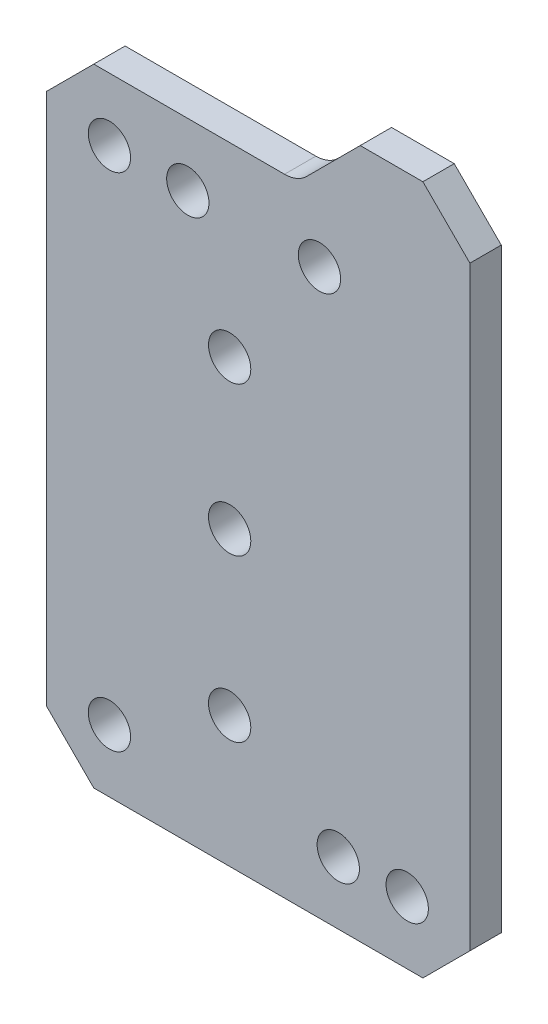
ISO-10303-21;
HEADER;
FILE_DESCRIPTION(('STEP AP214'),'2;1');
FILE_NAME('part.step','',(''),(''),'','','');
FILE_SCHEMA(('AUTOMOTIVE_DESIGN { 1 0 10303 214 1 1 1 1 }'));
ENDSEC;
DATA;
#1=APPLICATION_CONTEXT('core data for automotive mechanical design processes');
#2=APPLICATION_PROTOCOL_DEFINITION('international standard','automotive_design',2000,#1);
#3=PRODUCT_CONTEXT('',#1,'mechanical');
#4=PRODUCT('Part','Part','',(#3));
#5=PRODUCT_RELATED_PRODUCT_CATEGORY('part','',(#4));
#6=PRODUCT_DEFINITION_FORMATION('','',#4);
#7=PRODUCT_DEFINITION_CONTEXT('part definition',#1,'design');
#8=PRODUCT_DEFINITION('design','',#6,#7);
#9=PRODUCT_DEFINITION_SHAPE('','',#8);
#10=(LENGTH_UNIT() NAMED_UNIT(*) SI_UNIT(.MILLI.,.METRE.));
#11=(NAMED_UNIT(*) PLANE_ANGLE_UNIT() SI_UNIT($,.RADIAN.));
#12=(NAMED_UNIT(*) SI_UNIT($,.STERADIAN.) SOLID_ANGLE_UNIT());
#13=UNCERTAINTY_MEASURE_WITH_UNIT(LENGTH_MEASURE(1.E-05),#10,'distance_accuracy_value','');
#14=(GEOMETRIC_REPRESENTATION_CONTEXT(3) GLOBAL_UNCERTAINTY_ASSIGNED_CONTEXT((#13)) GLOBAL_UNIT_ASSIGNED_CONTEXT((#10,
#11,#12)) REPRESENTATION_CONTEXT('',''));
#15=CARTESIAN_POINT('',(0.,0.,0.));
#16=DIRECTION('',(0.,0.,1.));
#17=DIRECTION('',(1.,0.,0.));
#18=AXIS2_PLACEMENT_3D('',#15,#16,#17);
#19=CARTESIAN_POINT('',(545.756400678806,644.999999999951,10.));
#20=DIRECTION('',(0.,0.,1.));
#21=DIRECTION('',(1.,0.,0.));
#22=AXIS2_PLACEMENT_3D('',#19,#20,#21);
#23=PLANE('',#22);
#24=CARTESIAN_POINT('',(489.898536302537,614.999999999951,10.));
#25=DIRECTION('',(0.,0.,1.));
#26=DIRECTION('',(1.,0.,0.));
#27=AXIS2_PLACEMENT_3D('',#24,#25,#26);
#28=CIRCLE('',#27,6.74999999999996);
#29=CARTESIAN_POINT('',(496.648536302537,614.999999999951,10.));
#30=VERTEX_POINT('',#29);
#31=EDGE_CURVE('E301',#30,#30,#28,.T.);
#32=ORIENTED_EDGE('',*,*,#31,.F.);
#33=EDGE_LOOP('',(#32));
#34=FACE_BOUND('',#33,.T.);
#35=CARTESIAN_POINT('',(528.246102143016,575.749727554119,10.));
#36=DIRECTION('',(0.,0.,1.));
#37=DIRECTION('',(1.,0.,0.));
#38=AXIS2_PLACEMENT_3D('',#35,#36,#37);
#39=CIRCLE('',#38,6.75000000000005);
#40=CARTESIAN_POINT('',(534.996102143016,575.749727554119,10.));
#41=VERTEX_POINT('',#40);
#42=EDGE_CURVE('E313',#41,#41,#39,.T.);
#43=ORIENTED_EDGE('',*,*,#42,.F.);
#44=EDGE_LOOP('',(#43));
#45=FACE_BOUND('',#44,.T.);
#46=CARTESIAN_POINT('',(528.246102145376,476.749727554119,10.));
#47=DIRECTION('',(0.,0.,1.));
#48=DIRECTION('',(1.,0.,0.));
#49=AXIS2_PLACEMENT_3D('',#46,#47,#48);
#50=CIRCLE('',#49,6.75000000000003);
#51=CARTESIAN_POINT('',(534.996102145376,476.749727554119,10.));
#52=VERTEX_POINT('',#51);
#53=EDGE_CURVE('E325',#52,#52,#50,.T.);
#54=ORIENTED_EDGE('',*,*,#53,.F.);
#55=EDGE_LOOP('',(#54));
#56=FACE_BOUND('',#55,.T.);
#57=CARTESIAN_POINT('',(562.898536302537,454.999999999951,10.));
#58=DIRECTION('',(0.,0.,1.));
#59=DIRECTION('',(1.,0.,0.));
#60=AXIS2_PLACEMENT_3D('',#57,#58,#59);
#61=CIRCLE('',#60,6.75000000000003);
#62=CARTESIAN_POINT('',(569.648536302537,454.999999999951,10.));
#63=VERTEX_POINT('',#62);
#64=EDGE_CURVE('E337',#63,#63,#61,.T.);
#65=ORIENTED_EDGE('',*,*,#64,.F.);
#66=EDGE_LOOP('',(#65));
#67=FACE_BOUND('',#66,.T.);
#68=DIRECTION('',(-0.707106781186545,-0.70710678118655,0.));
#69=VECTOR('',#68,1.);
#70=CARTESIAN_POINT('',(484.898536302537,634.999999999951,10.));
#71=LINE('',#70,#69);
#72=CARTESIAN_POINT('',(484.898536302537,634.999999999951,10.));
#73=VERTEX_POINT('',#72);
#74=CARTESIAN_POINT('',(469.898536302537,619.999999999951,10.));
#75=VERTEX_POINT('',#74);
#76=EDGE_CURVE('E172',#73,#75,#71,.T.);
#77=ORIENTED_EDGE('',*,*,#76,.T.);
#78=DIRECTION('',(0.,-1.,0.));
#79=VECTOR('',#78,1.);
#80=CARTESIAN_POINT('',(469.898536302537,619.999999999951,10.));
#81=LINE('',#80,#79);
#82=CARTESIAN_POINT('',(469.898536302537,449.999999999951,10.));
#83=VERTEX_POINT('',#82);
#84=EDGE_CURVE('E105',#75,#83,#81,.T.);
#85=ORIENTED_EDGE('',*,*,#84,.T.);
#86=DIRECTION('',(0.707106781186548,-0.707106781186548,0.));
#87=VECTOR('',#86,1.);
#88=CARTESIAN_POINT('',(469.898536302537,449.999999999951,10.));
#89=LINE('',#88,#87);
#90=CARTESIAN_POINT('',(484.898536302538,434.999999999951,10.));
#91=VERTEX_POINT('',#90);
#92=EDGE_CURVE('E196',#83,#91,#89,.T.);
#93=ORIENTED_EDGE('',*,*,#92,.T.);
#94=DIRECTION('',(1.,0.,0.));
#95=VECTOR('',#94,1.);
#96=CARTESIAN_POINT('',(484.898536302538,434.999999999951,10.));
#97=LINE('',#96,#95);
#98=CARTESIAN_POINT('',(589.898536302537,434.999999999951,10.));
#99=VERTEX_POINT('',#98);
#100=EDGE_CURVE('E215',#91,#99,#97,.T.);
#101=ORIENTED_EDGE('',*,*,#100,.T.);
#102=DIRECTION('',(0.707106781186548,0.707106781186548,0.));
#103=VECTOR('',#102,1.);
#104=CARTESIAN_POINT('',(589.898536302537,434.999999999951,10.));
#105=LINE('',#104,#103);
#106=CARTESIAN_POINT('',(604.898536302537,449.999999999951,10.));
#107=VERTEX_POINT('',#106);
#108=EDGE_CURVE('E212',#99,#107,#105,.T.);
#109=ORIENTED_EDGE('',*,*,#108,.T.);
#110=DIRECTION('',(0.,1.,0.));
#111=VECTOR('',#110,1.);
#112=CARTESIAN_POINT('',(604.898536302537,449.999999999951,10.));
#113=LINE('',#112,#111);
#114=CARTESIAN_POINT('',(604.898536302537,639.999999999951,10.));
#115=VERTEX_POINT('',#114);
#116=EDGE_CURVE('E214',#107,#115,#113,.T.);
#117=ORIENTED_EDGE('',*,*,#116,.T.);
#118=DIRECTION('',(-0.707106781186548,0.707106781186548,0.));
#119=VECTOR('',#118,1.);
#120=CARTESIAN_POINT('',(604.898536302537,639.999999999951,10.));
#121=LINE('',#120,#119);
#122=CARTESIAN_POINT('',(589.898536302537,654.999999999951,10.));
#123=VERTEX_POINT('',#122);
#124=EDGE_CURVE('E217',#115,#123,#121,.T.);
#125=ORIENTED_EDGE('',*,*,#124,.T.);
#126=DIRECTION('',(-1.,0.,0.));
#127=VECTOR('',#126,1.);
#128=CARTESIAN_POINT('',(589.898536302537,654.999999999951,10.));
#129=LINE('',#128,#127);
#130=CARTESIAN_POINT('',(569.898536302537,654.999999999951,10.));
#131=VERTEX_POINT('',#130);
#132=EDGE_CURVE('E133',#123,#131,#129,.T.);
#133=ORIENTED_EDGE('',*,*,#132,.T.);
#134=DIRECTION('',(-0.70710678118655,-0.707106781186545,0.));
#135=VECTOR('',#134,1.);
#136=CARTESIAN_POINT('',(569.898536302537,654.999999999951,10.));
#137=LINE('',#136,#135);
#138=CARTESIAN_POINT('',(552.827468490672,637.928932188085,10.));
#139=VERTEX_POINT('',#138);
#140=EDGE_CURVE('E127',#131,#139,#137,.T.);
#141=ORIENTED_EDGE('',*,*,#140,.T.);
#142=CARTESIAN_POINT('',(545.756400678806,644.999999999951,10.));
#143=DIRECTION('',(0.,0.,-1.));
#144=DIRECTION('',(1.,0.,0.));
#145=AXIS2_PLACEMENT_3D('',#142,#143,#144);
#146=CIRCLE('',#145,9.99999999999997);
#147=CARTESIAN_POINT('',(545.756400678806,634.999999999951,10.));
#148=VERTEX_POINT('',#147);
#149=EDGE_CURVE('E131',#139,#148,#146,.T.);
#150=ORIENTED_EDGE('',*,*,#149,.T.);
#151=DIRECTION('',(-1.,0.,0.));
#152=VECTOR('',#151,1.);
#153=CARTESIAN_POINT('',(545.756400678806,634.999999999951,10.));
#154=LINE('',#153,#152);
#155=EDGE_CURVE('E53',#148,#73,#154,.T.);
#156=ORIENTED_EDGE('',*,*,#155,.T.);
#157=EDGE_LOOP('',(#77,#85,#93,#101,#109,#117,#125,#133,#141,#150,#156));
#158=FACE_BOUND('',#157,.T.);
#159=CARTESIAN_POINT('',(584.898536302537,454.999999999951,10.));
#160=DIRECTION('',(0.,0.,1.));
#161=DIRECTION('',(1.,0.,0.));
#162=AXIS2_PLACEMENT_3D('',#159,#160,#161);
#163=CIRCLE('',#162,6.75000000000003);
#164=CARTESIAN_POINT('',(591.648536302537,454.999999999951,10.));
#165=VERTEX_POINT('',#164);
#166=EDGE_CURVE('E155',#165,#165,#163,.T.);
#167=ORIENTED_EDGE('',*,*,#166,.F.);
#168=EDGE_LOOP('',(#167));
#169=FACE_BOUND('',#168,.T.);
#170=CARTESIAN_POINT('',(489.898536302537,454.999999999951,10.));
#171=DIRECTION('',(0.,0.,1.));
#172=DIRECTION('',(1.,0.,0.));
#173=AXIS2_PLACEMENT_3D('',#170,#171,#172);
#174=CIRCLE('',#173,6.74999999999998);
#175=CARTESIAN_POINT('',(496.648536302537,454.999999999951,10.));
#176=VERTEX_POINT('',#175);
#177=EDGE_CURVE('E331',#176,#176,#174,.T.);
#178=ORIENTED_EDGE('',*,*,#177,.F.);
#179=EDGE_LOOP('',(#178));
#180=FACE_BOUND('',#179,.T.);
#181=CARTESIAN_POINT('',(528.246102144148,528.249727554119,10.));
#182=DIRECTION('',(0.,0.,1.));
#183=DIRECTION('',(1.,0.,0.));
#184=AXIS2_PLACEMENT_3D('',#181,#182,#183);
#185=CIRCLE('',#184,6.75000000000005);
#186=CARTESIAN_POINT('',(534.996102144148,528.249727554119,10.));
#187=VERTEX_POINT('',#186);
#188=EDGE_CURVE('E319',#187,#187,#185,.T.);
#189=ORIENTED_EDGE('',*,*,#188,.F.);
#190=EDGE_LOOP('',(#189));
#191=FACE_BOUND('',#190,.T.);
#192=CARTESIAN_POINT('',(514.898536302537,614.999999999951,10.));
#193=DIRECTION('',(0.,0.,1.));
#194=DIRECTION('',(1.,0.,0.));
#195=AXIS2_PLACEMENT_3D('',#192,#193,#194);
#196=CIRCLE('',#195,6.75000000000005);
#197=CARTESIAN_POINT('',(521.648536302537,614.999999999951,10.));
#198=VERTEX_POINT('',#197);
#199=EDGE_CURVE('E307',#198,#198,#196,.T.);
#200=ORIENTED_EDGE('',*,*,#199,.F.);
#201=EDGE_LOOP('',(#200));
#202=FACE_BOUND('',#201,.T.);
#203=CARTESIAN_POINT('',(556.898536302537,614.999999999951,10.));
#204=DIRECTION('',(0.,0.,1.));
#205=DIRECTION('',(1.,0.,0.));
#206=AXIS2_PLACEMENT_3D('',#203,#204,#205);
#207=CIRCLE('',#206,6.75000000000005);
#208=CARTESIAN_POINT('',(563.648536302537,614.999999999951,10.));
#209=VERTEX_POINT('',#208);
#210=EDGE_CURVE('E292',#209,#209,#207,.T.);
#211=ORIENTED_EDGE('',*,*,#210,.F.);
#212=EDGE_LOOP('',(#211));
#213=FACE_BOUND('',#212,.T.);
#214=ADVANCED_FACE('F36',(#34,#45,#56,#67,#158,#169,#180,#191,#202,#213),#23,.T.);
#215=CARTESIAN_POINT('',(545.756400678806,644.999999999951,0.));
#216=DIRECTION('',(0.,0.,1.));
#217=DIRECTION('',(1.,0.,0.));
#218=AXIS2_PLACEMENT_3D('',#215,#216,#217);
#219=PLANE('',#218);
#220=CARTESIAN_POINT('',(489.898536302537,614.999999999951,0.));
#221=DIRECTION('',(0.,0.,1.));
#222=DIRECTION('',(1.,0.,0.));
#223=AXIS2_PLACEMENT_3D('',#220,#221,#222);
#224=CIRCLE('',#223,6.74999999999996);
#225=CARTESIAN_POINT('',(496.648536302537,614.999999999951,0.));
#226=VERTEX_POINT('',#225);
#227=EDGE_CURVE('E298',#226,#226,#224,.T.);
#228=ORIENTED_EDGE('',*,*,#227,.T.);
#229=EDGE_LOOP('',(#228));
#230=FACE_BOUND('',#229,.T.);
#231=CARTESIAN_POINT('',(528.246102143016,575.749727554119,0.));
#232=DIRECTION('',(0.,0.,1.));
#233=DIRECTION('',(1.,0.,0.));
#234=AXIS2_PLACEMENT_3D('',#231,#232,#233);
#235=CIRCLE('',#234,6.75000000000005);
#236=CARTESIAN_POINT('',(534.996102143016,575.749727554119,0.));
#237=VERTEX_POINT('',#236);
#238=EDGE_CURVE('E310',#237,#237,#235,.T.);
#239=ORIENTED_EDGE('',*,*,#238,.T.);
#240=EDGE_LOOP('',(#239));
#241=FACE_BOUND('',#240,.T.);
#242=CARTESIAN_POINT('',(528.246102145376,476.749727554119,0.));
#243=DIRECTION('',(0.,0.,1.));
#244=DIRECTION('',(1.,0.,0.));
#245=AXIS2_PLACEMENT_3D('',#242,#243,#244);
#246=CIRCLE('',#245,6.75000000000003);
#247=CARTESIAN_POINT('',(534.996102145376,476.749727554119,0.));
#248=VERTEX_POINT('',#247);
#249=EDGE_CURVE('E322',#248,#248,#246,.T.);
#250=ORIENTED_EDGE('',*,*,#249,.T.);
#251=EDGE_LOOP('',(#250));
#252=FACE_BOUND('',#251,.T.);
#253=CARTESIAN_POINT('',(562.898536302537,454.999999999951,0.));
#254=DIRECTION('',(0.,0.,1.));
#255=DIRECTION('',(1.,0.,0.));
#256=AXIS2_PLACEMENT_3D('',#253,#254,#255);
#257=CIRCLE('',#256,6.75000000000003);
#258=CARTESIAN_POINT('',(569.648536302537,454.999999999951,0.));
#259=VERTEX_POINT('',#258);
#260=EDGE_CURVE('E334',#259,#259,#257,.T.);
#261=ORIENTED_EDGE('',*,*,#260,.T.);
#262=EDGE_LOOP('',(#261));
#263=FACE_BOUND('',#262,.T.);
#264=DIRECTION('',(-0.707106781186545,-0.70710678118655,0.));
#265=VECTOR('',#264,1.);
#266=CARTESIAN_POINT('',(484.898536302537,634.999999999951,0.));
#267=LINE('',#266,#265);
#268=CARTESIAN_POINT('',(484.898536302537,634.999999999951,0.));
#269=VERTEX_POINT('',#268);
#270=CARTESIAN_POINT('',(469.898536302537,619.999999999951,0.));
#271=VERTEX_POINT('',#270);
#272=EDGE_CURVE('E151',#269,#271,#267,.T.);
#273=ORIENTED_EDGE('',*,*,#272,.F.);
#274=DIRECTION('',(-1.,0.,0.));
#275=VECTOR('',#274,1.);
#276=CARTESIAN_POINT('',(545.756400678806,634.999999999951,0.));
#277=LINE('',#276,#275);
#278=CARTESIAN_POINT('',(545.756400678806,634.999999999951,0.));
#279=VERTEX_POINT('',#278);
#280=EDGE_CURVE('E97',#279,#269,#277,.T.);
#281=ORIENTED_EDGE('',*,*,#280,.F.);
#282=CARTESIAN_POINT('',(545.756400678806,644.999999999951,0.));
#283=DIRECTION('',(0.,0.,-1.));
#284=DIRECTION('',(1.,0.,0.));
#285=AXIS2_PLACEMENT_3D('',#282,#283,#284);
#286=CIRCLE('',#285,9.99999999999997);
#287=CARTESIAN_POINT('',(552.827468490672,637.928932188085,0.));
#288=VERTEX_POINT('',#287);
#289=EDGE_CURVE('E91',#288,#279,#286,.T.);
#290=ORIENTED_EDGE('',*,*,#289,.F.);
#291=DIRECTION('',(-0.70710678118655,-0.707106781186545,0.));
#292=VECTOR('',#291,1.);
#293=CARTESIAN_POINT('',(569.898536302537,654.999999999951,0.));
#294=LINE('',#293,#292);
#295=CARTESIAN_POINT('',(569.898536302537,654.999999999951,0.));
#296=VERTEX_POINT('',#295);
#297=EDGE_CURVE('E141',#296,#288,#294,.T.);
#298=ORIENTED_EDGE('',*,*,#297,.F.);
#299=DIRECTION('',(-1.,0.,0.));
#300=VECTOR('',#299,1.);
#301=CARTESIAN_POINT('',(589.898536302537,654.999999999951,0.));
#302=LINE('',#301,#300);
#303=CARTESIAN_POINT('',(589.898536302537,654.999999999951,0.));
#304=VERTEX_POINT('',#303);
#305=EDGE_CURVE('E167',#304,#296,#302,.T.);
#306=ORIENTED_EDGE('',*,*,#305,.F.);
#307=DIRECTION('',(-0.707106781186548,0.707106781186548,0.));
#308=VECTOR('',#307,1.);
#309=CARTESIAN_POINT('',(604.898536302537,639.999999999951,0.));
#310=LINE('',#309,#308);
#311=CARTESIAN_POINT('',(604.898536302537,639.999999999951,0.));
#312=VERTEX_POINT('',#311);
#313=EDGE_CURVE('E165',#312,#304,#310,.T.);
#314=ORIENTED_EDGE('',*,*,#313,.F.);
#315=DIRECTION('',(0.,1.,0.));
#316=VECTOR('',#315,1.);
#317=CARTESIAN_POINT('',(604.898536302537,449.999999999951,0.));
#318=LINE('',#317,#316);
#319=CARTESIAN_POINT('',(604.898536302537,449.999999999951,0.));
#320=VERTEX_POINT('',#319);
#321=EDGE_CURVE('E163',#320,#312,#318,.T.);
#322=ORIENTED_EDGE('',*,*,#321,.F.);
#323=DIRECTION('',(0.707106781186548,0.707106781186548,0.));
#324=VECTOR('',#323,1.);
#325=CARTESIAN_POINT('',(589.898536302537,434.999999999951,0.));
#326=LINE('',#325,#324);
#327=CARTESIAN_POINT('',(589.898536302537,434.999999999951,0.));
#328=VERTEX_POINT('',#327);
#329=EDGE_CURVE('E161',#328,#320,#326,.T.);
#330=ORIENTED_EDGE('',*,*,#329,.F.);
#331=DIRECTION('',(1.,0.,0.));
#332=VECTOR('',#331,1.);
#333=CARTESIAN_POINT('',(484.898536302538,434.999999999951,0.));
#334=LINE('',#333,#332);
#335=CARTESIAN_POINT('',(484.898536302538,434.999999999951,0.));
#336=VERTEX_POINT('',#335);
#337=EDGE_CURVE('E159',#336,#328,#334,.T.);
#338=ORIENTED_EDGE('',*,*,#337,.F.);
#339=DIRECTION('',(0.707106781186548,-0.707106781186548,0.));
#340=VECTOR('',#339,1.);
#341=CARTESIAN_POINT('',(469.898536302537,449.999999999951,0.));
#342=LINE('',#341,#340);
#343=CARTESIAN_POINT('',(469.898536302537,449.999999999951,0.));
#344=VERTEX_POINT('',#343);
#345=EDGE_CURVE('E157',#344,#336,#342,.T.);
#346=ORIENTED_EDGE('',*,*,#345,.F.);
#347=DIRECTION('',(0.,-1.,0.));
#348=VECTOR('',#347,1.);
#349=CARTESIAN_POINT('',(469.898536302537,619.999999999951,0.));
#350=LINE('',#349,#348);
#351=EDGE_CURVE('E154',#271,#344,#350,.T.);
#352=ORIENTED_EDGE('',*,*,#351,.F.);
#353=EDGE_LOOP('',(#273,#281,#290,#298,#306,#314,#322,#330,#338,#346,#352));
#354=FACE_BOUND('',#353,.T.);
#355=CARTESIAN_POINT('',(584.898536302537,454.999999999951,0.));
#356=DIRECTION('',(0.,0.,1.));
#357=DIRECTION('',(1.,0.,0.));
#358=AXIS2_PLACEMENT_3D('',#355,#356,#357);
#359=CIRCLE('',#358,6.75000000000003);
#360=CARTESIAN_POINT('',(591.648536302537,454.999999999951,0.));
#361=VERTEX_POINT('',#360);
#362=EDGE_CURVE('E340',#361,#361,#359,.T.);
#363=ORIENTED_EDGE('',*,*,#362,.T.);
#364=EDGE_LOOP('',(#363));
#365=FACE_BOUND('',#364,.T.);
#366=CARTESIAN_POINT('',(489.898536302537,454.999999999951,0.));
#367=DIRECTION('',(0.,0.,1.));
#368=DIRECTION('',(1.,0.,0.));
#369=AXIS2_PLACEMENT_3D('',#366,#367,#368);
#370=CIRCLE('',#369,6.74999999999998);
#371=CARTESIAN_POINT('',(496.648536302537,454.999999999951,0.));
#372=VERTEX_POINT('',#371);
#373=EDGE_CURVE('E328',#372,#372,#370,.T.);
#374=ORIENTED_EDGE('',*,*,#373,.T.);
#375=EDGE_LOOP('',(#374));
#376=FACE_BOUND('',#375,.T.);
#377=CARTESIAN_POINT('',(528.246102144148,528.249727554119,0.));
#378=DIRECTION('',(0.,0.,1.));
#379=DIRECTION('',(1.,0.,0.));
#380=AXIS2_PLACEMENT_3D('',#377,#378,#379);
#381=CIRCLE('',#380,6.75000000000005);
#382=CARTESIAN_POINT('',(534.996102144148,528.249727554119,0.));
#383=VERTEX_POINT('',#382);
#384=EDGE_CURVE('E316',#383,#383,#381,.T.);
#385=ORIENTED_EDGE('',*,*,#384,.T.);
#386=EDGE_LOOP('',(#385));
#387=FACE_BOUND('',#386,.T.);
#388=CARTESIAN_POINT('',(514.898536302537,614.999999999951,0.));
#389=DIRECTION('',(0.,0.,1.));
#390=DIRECTION('',(1.,0.,0.));
#391=AXIS2_PLACEMENT_3D('',#388,#389,#390);
#392=CIRCLE('',#391,6.75000000000005);
#393=CARTESIAN_POINT('',(521.648536302537,614.999999999951,0.));
#394=VERTEX_POINT('',#393);
#395=EDGE_CURVE('E304',#394,#394,#392,.T.);
#396=ORIENTED_EDGE('',*,*,#395,.T.);
#397=EDGE_LOOP('',(#396));
#398=FACE_BOUND('',#397,.T.);
#399=CARTESIAN_POINT('',(556.898536302537,614.999999999951,0.));
#400=DIRECTION('',(0.,0.,1.));
#401=DIRECTION('',(1.,0.,0.));
#402=AXIS2_PLACEMENT_3D('',#399,#400,#401);
#403=CIRCLE('',#402,6.75000000000005);
#404=CARTESIAN_POINT('',(563.648536302537,614.999999999951,0.));
#405=VERTEX_POINT('',#404);
#406=EDGE_CURVE('E295',#405,#405,#403,.T.);
#407=ORIENTED_EDGE('',*,*,#406,.T.);
#408=EDGE_LOOP('',(#407));
#409=FACE_BOUND('',#408,.T.);
#410=ADVANCED_FACE('F200',(#230,#241,#252,#263,#354,#365,#376,#387,#398,#409),#219,.F.);
#411=CARTESIAN_POINT('',(484.898536302537,634.999999999951,10.));
#412=DIRECTION('',(0.70710678118655,-0.707106781186545,0.));
#413=DIRECTION('',(0.707106781186545,0.70710678118655,0.));
#414=AXIS2_PLACEMENT_3D('',#411,#412,#413);
#415=PLANE('',#414);
#416=ORIENTED_EDGE('',*,*,#272,.T.);
#417=DIRECTION('',(0.,0.,-1.));
#418=VECTOR('',#417,1.);
#419=CARTESIAN_POINT('',(469.898536302537,619.999999999951,10.));
#420=LINE('',#419,#418);
#421=EDGE_CURVE('E11',#75,#271,#420,.T.);
#422=ORIENTED_EDGE('',*,*,#421,.F.);
#423=ORIENTED_EDGE('',*,*,#76,.F.);
#424=DIRECTION('',(0.,0.,-1.));
#425=VECTOR('',#424,1.);
#426=CARTESIAN_POINT('',(484.898536302537,634.999999999951,10.));
#427=LINE('',#426,#425);
#428=EDGE_CURVE('E147',#73,#269,#427,.T.);
#429=ORIENTED_EDGE('',*,*,#428,.T.);
#430=EDGE_LOOP('',(#416,#422,#423,#429));
#431=FACE_BOUND('',#430,.T.);
#432=ADVANCED_FACE('F38',(#431),#415,.F.);
#433=CARTESIAN_POINT('',(469.898536302537,619.999999999951,10.));
#434=DIRECTION('',(1.,0.,0.));
#435=DIRECTION('',(0.,1.,0.));
#436=AXIS2_PLACEMENT_3D('',#433,#434,#435);
#437=PLANE('',#436);
#438=ORIENTED_EDGE('',*,*,#351,.T.);
#439=DIRECTION('',(0.,0.,-1.));
#440=VECTOR('',#439,1.);
#441=CARTESIAN_POINT('',(469.898536302537,449.999999999951,10.));
#442=LINE('',#441,#440);
#443=EDGE_CURVE('E45',#83,#344,#442,.T.);
#444=ORIENTED_EDGE('',*,*,#443,.F.);
#445=ORIENTED_EDGE('',*,*,#84,.F.);
#446=ORIENTED_EDGE('',*,*,#421,.T.);
#447=EDGE_LOOP('',(#438,#444,#445,#446));
#448=FACE_BOUND('',#447,.T.);
#449=ADVANCED_FACE('F527',(#448),#437,.F.);
#450=CARTESIAN_POINT('',(469.898536302537,449.999999999951,10.));
#451=DIRECTION('',(0.707106781186548,0.707106781186548,0.));
#452=DIRECTION('',(-0.707106781186548,0.707106781186548,0.));
#453=AXIS2_PLACEMENT_3D('',#450,#451,#452);
#454=PLANE('',#453);
#455=ORIENTED_EDGE('',*,*,#345,.T.);
#456=DIRECTION('',(0.,0.,-1.));
#457=VECTOR('',#456,1.);
#458=CARTESIAN_POINT('',(484.898536302538,434.999999999951,10.));
#459=LINE('',#458,#457);
#460=EDGE_CURVE('E188',#91,#336,#459,.T.);
#461=ORIENTED_EDGE('',*,*,#460,.F.);
#462=ORIENTED_EDGE('',*,*,#92,.F.);
#463=ORIENTED_EDGE('',*,*,#443,.T.);
#464=EDGE_LOOP('',(#455,#461,#462,#463));
#465=FACE_BOUND('',#464,.T.);
#466=ADVANCED_FACE('F194',(#465),#454,.F.);
#467=CARTESIAN_POINT('',(484.898536302538,434.999999999951,10.));
#468=DIRECTION('',(0.,1.,0.));
#469=DIRECTION('',(0.,0.,1.));
#470=AXIS2_PLACEMENT_3D('',#467,#468,#469);
#471=PLANE('',#470);
#472=ORIENTED_EDGE('',*,*,#337,.T.);
#473=DIRECTION('',(0.,0.,-1.));
#474=VECTOR('',#473,1.);
#475=CARTESIAN_POINT('',(589.898536302537,434.999999999951,10.));
#476=LINE('',#475,#474);
#477=EDGE_CURVE('E185',#99,#328,#476,.T.);
#478=ORIENTED_EDGE('',*,*,#477,.F.);
#479=ORIENTED_EDGE('',*,*,#100,.F.);
#480=ORIENTED_EDGE('',*,*,#460,.T.);
#481=EDGE_LOOP('',(#472,#478,#479,#480));
#482=FACE_BOUND('',#481,.T.);
#483=ADVANCED_FACE('F206',(#482),#471,.F.);
#484=CARTESIAN_POINT('',(589.898536302537,434.999999999951,10.));
#485=DIRECTION('',(-0.707106781186548,0.707106781186548,0.));
#486=DIRECTION('',(-0.707106781186548,-0.707106781186548,0.));
#487=AXIS2_PLACEMENT_3D('',#484,#485,#486);
#488=PLANE('',#487);
#489=ORIENTED_EDGE('',*,*,#329,.T.);
#490=DIRECTION('',(0.,0.,-1.));
#491=VECTOR('',#490,1.);
#492=CARTESIAN_POINT('',(604.898536302537,449.999999999951,10.));
#493=LINE('',#492,#491);
#494=EDGE_CURVE('E182',#107,#320,#493,.T.);
#495=ORIENTED_EDGE('',*,*,#494,.F.);
#496=ORIENTED_EDGE('',*,*,#108,.F.);
#497=ORIENTED_EDGE('',*,*,#477,.T.);
#498=EDGE_LOOP('',(#489,#495,#496,#497));
#499=FACE_BOUND('',#498,.T.);
#500=ADVANCED_FACE('F210',(#499),#488,.F.);
#501=CARTESIAN_POINT('',(604.898536302537,449.999999999951,10.));
#502=DIRECTION('',(-1.,0.,0.));
#503=DIRECTION('',(0.,0.,1.));
#504=AXIS2_PLACEMENT_3D('',#501,#502,#503);
#505=PLANE('',#504);
#506=ORIENTED_EDGE('',*,*,#321,.T.);
#507=DIRECTION('',(0.,0.,-1.));
#508=VECTOR('',#507,1.);
#509=CARTESIAN_POINT('',(604.898536302537,639.999999999951,10.));
#510=LINE('',#509,#508);
#511=EDGE_CURVE('E179',#115,#312,#510,.T.);
#512=ORIENTED_EDGE('',*,*,#511,.F.);
#513=ORIENTED_EDGE('',*,*,#116,.F.);
#514=ORIENTED_EDGE('',*,*,#494,.T.);
#515=EDGE_LOOP('',(#506,#512,#513,#514));
#516=FACE_BOUND('',#515,.T.);
#517=ADVANCED_FACE('F492',(#516),#505,.F.);
#518=CARTESIAN_POINT('',(604.898536302537,639.999999999951,10.));
#519=DIRECTION('',(-0.707106781186548,-0.707106781186548,0.));
#520=DIRECTION('',(0.707106781186548,-0.707106781186548,0.));
#521=AXIS2_PLACEMENT_3D('',#518,#519,#520);
#522=PLANE('',#521);
#523=ORIENTED_EDGE('',*,*,#313,.T.);
#524=DIRECTION('',(0.,0.,-1.));
#525=VECTOR('',#524,1.);
#526=CARTESIAN_POINT('',(589.898536302537,654.999999999951,10.));
#527=LINE('',#526,#525);
#528=EDGE_CURVE('E176',#123,#304,#527,.T.);
#529=ORIENTED_EDGE('',*,*,#528,.F.);
#530=ORIENTED_EDGE('',*,*,#124,.F.);
#531=ORIENTED_EDGE('',*,*,#511,.T.);
#532=EDGE_LOOP('',(#523,#529,#530,#531));
#533=FACE_BOUND('',#532,.T.);
#534=ADVANCED_FACE('F226',(#533),#522,.F.);
#535=CARTESIAN_POINT('',(589.898536302537,654.999999999951,10.));
#536=DIRECTION('',(0.,-1.,0.));
#537=DIRECTION('',(0.,0.,-1.));
#538=AXIS2_PLACEMENT_3D('',#535,#536,#537);
#539=PLANE('',#538);
#540=ORIENTED_EDGE('',*,*,#305,.T.);
#541=DIRECTION('',(0.,0.,-1.));
#542=VECTOR('',#541,1.);
#543=CARTESIAN_POINT('',(569.898536302537,654.999999999951,10.));
#544=LINE('',#543,#542);
#545=EDGE_CURVE('E142',#131,#296,#544,.T.);
#546=ORIENTED_EDGE('',*,*,#545,.F.);
#547=ORIENTED_EDGE('',*,*,#132,.F.);
#548=ORIENTED_EDGE('',*,*,#528,.T.);
#549=EDGE_LOOP('',(#540,#546,#547,#548));
#550=FACE_BOUND('',#549,.T.);
#551=ADVANCED_FACE('F230',(#550),#539,.F.);
#552=CARTESIAN_POINT('',(569.898536302537,654.999999999951,10.));
#553=DIRECTION('',(0.707106781186545,-0.70710678118655,0.));
#554=DIRECTION('',(0.70710678118655,0.707106781186545,0.));
#555=AXIS2_PLACEMENT_3D('',#552,#553,#554);
#556=PLANE('',#555);
#557=ORIENTED_EDGE('',*,*,#297,.T.);
#558=DIRECTION('',(0.,0.,-1.));
#559=VECTOR('',#558,1.);
#560=CARTESIAN_POINT('',(552.827468490672,637.928932188085,10.));
#561=LINE('',#560,#559);
#562=EDGE_CURVE('E138',#139,#288,#561,.T.);
#563=ORIENTED_EDGE('',*,*,#562,.F.);
#564=ORIENTED_EDGE('',*,*,#140,.F.);
#565=ORIENTED_EDGE('',*,*,#545,.T.);
#566=EDGE_LOOP('',(#557,#563,#564,#565));
#567=FACE_BOUND('',#566,.T.);
#568=ADVANCED_FACE('F139',(#567),#556,.F.);
#569=CARTESIAN_POINT('',(545.756400678806,644.999999999951,10.));
#570=DIRECTION('',(0.,0.,-1.));
#571=DIRECTION('',(-1.,0.,0.));
#572=AXIS2_PLACEMENT_3D('',#569,#570,#571);
#573=CYLINDRICAL_SURFACE('',#572,9.99999999999997);
#574=ORIENTED_EDGE('',*,*,#289,.T.);
#575=DIRECTION('',(0.,0.,-1.));
#576=VECTOR('',#575,1.);
#577=CARTESIAN_POINT('',(545.756400678806,634.999999999951,10.));
#578=LINE('',#577,#576);
#579=EDGE_CURVE('E143',#148,#279,#578,.T.);
#580=ORIENTED_EDGE('',*,*,#579,.F.);
#581=ORIENTED_EDGE('',*,*,#149,.F.);
#582=ORIENTED_EDGE('',*,*,#562,.T.);
#583=EDGE_LOOP('',(#574,#580,#581,#582));
#584=FACE_BOUND('',#583,.T.);
#585=ADVANCED_FACE('F145',(#584),#573,.F.);
#586=CARTESIAN_POINT('',(545.756400678806,634.999999999951,10.));
#587=DIRECTION('',(0.,-1.,0.));
#588=DIRECTION('',(1.,0.,0.));
#589=AXIS2_PLACEMENT_3D('',#586,#587,#588);
#590=PLANE('',#589);
#591=ORIENTED_EDGE('',*,*,#280,.T.);
#592=ORIENTED_EDGE('',*,*,#428,.F.);
#593=ORIENTED_EDGE('',*,*,#155,.F.);
#594=ORIENTED_EDGE('',*,*,#579,.T.);
#595=EDGE_LOOP('',(#591,#592,#593,#594));
#596=FACE_BOUND('',#595,.T.);
#597=ADVANCED_FACE('F234',(#596),#590,.F.);
#598=CARTESIAN_POINT('',(584.898536302537,454.999999999951,10.));
#599=DIRECTION('',(0.,0.,-1.));
#600=DIRECTION('',(-1.,0.,0.));
#601=AXIS2_PLACEMENT_3D('',#598,#599,#600);
#602=CYLINDRICAL_SURFACE('',#601,6.75000000000003);
#603=ORIENTED_EDGE('',*,*,#166,.T.);
#604=EDGE_LOOP('',(#603));
#605=FACE_BOUND('',#604,.T.);
#606=ORIENTED_EDGE('',*,*,#362,.F.);
#607=EDGE_LOOP('',(#606));
#608=FACE_BOUND('',#607,.T.);
#609=ADVANCED_FACE('F236',(#605,#608),#602,.F.);
#610=CARTESIAN_POINT('',(562.898536302537,454.999999999951,10.));
#611=DIRECTION('',(0.,0.,-1.));
#612=DIRECTION('',(-1.,0.,0.));
#613=AXIS2_PLACEMENT_3D('',#610,#611,#612);
#614=CYLINDRICAL_SURFACE('',#613,6.75000000000003);
#615=ORIENTED_EDGE('',*,*,#64,.T.);
#616=EDGE_LOOP('',(#615));
#617=FACE_BOUND('',#616,.T.);
#618=ORIENTED_EDGE('',*,*,#260,.F.);
#619=EDGE_LOOP('',(#618));
#620=FACE_BOUND('',#619,.T.);
#621=ADVANCED_FACE('F242',(#617,#620),#614,.F.);
#622=CARTESIAN_POINT('',(489.898536302537,454.999999999951,10.));
#623=DIRECTION('',(0.,0.,-1.));
#624=DIRECTION('',(-1.,0.,0.));
#625=AXIS2_PLACEMENT_3D('',#622,#623,#624);
#626=CYLINDRICAL_SURFACE('',#625,6.74999999999998);
#627=ORIENTED_EDGE('',*,*,#177,.T.);
#628=EDGE_LOOP('',(#627));
#629=FACE_BOUND('',#628,.T.);
#630=ORIENTED_EDGE('',*,*,#373,.F.);
#631=EDGE_LOOP('',(#630));
#632=FACE_BOUND('',#631,.T.);
#633=ADVANCED_FACE('F259',(#629,#632),#626,.F.);
#634=CARTESIAN_POINT('',(528.246102145376,476.749727554119,10.));
#635=DIRECTION('',(0.,0.,-1.));
#636=DIRECTION('',(-1.,0.,0.));
#637=AXIS2_PLACEMENT_3D('',#634,#635,#636);
#638=CYLINDRICAL_SURFACE('',#637,6.75000000000003);
#639=ORIENTED_EDGE('',*,*,#53,.T.);
#640=EDGE_LOOP('',(#639));
#641=FACE_BOUND('',#640,.T.);
#642=ORIENTED_EDGE('',*,*,#249,.F.);
#643=EDGE_LOOP('',(#642));
#644=FACE_BOUND('',#643,.T.);
#645=ADVANCED_FACE('F263',(#641,#644),#638,.F.);
#646=CARTESIAN_POINT('',(528.246102144148,528.249727554119,10.));
#647=DIRECTION('',(0.,0.,-1.));
#648=DIRECTION('',(-1.,0.,0.));
#649=AXIS2_PLACEMENT_3D('',#646,#647,#648);
#650=CYLINDRICAL_SURFACE('',#649,6.75000000000005);
#651=ORIENTED_EDGE('',*,*,#188,.T.);
#652=EDGE_LOOP('',(#651));
#653=FACE_BOUND('',#652,.T.);
#654=ORIENTED_EDGE('',*,*,#384,.F.);
#655=EDGE_LOOP('',(#654));
#656=FACE_BOUND('',#655,.T.);
#657=ADVANCED_FACE('F267',(#653,#656),#650,.F.);
#658=CARTESIAN_POINT('',(528.246102143016,575.749727554119,10.));
#659=DIRECTION('',(0.,0.,-1.));
#660=DIRECTION('',(-1.,0.,0.));
#661=AXIS2_PLACEMENT_3D('',#658,#659,#660);
#662=CYLINDRICAL_SURFACE('',#661,6.75000000000005);
#663=ORIENTED_EDGE('',*,*,#42,.T.);
#664=EDGE_LOOP('',(#663));
#665=FACE_BOUND('',#664,.T.);
#666=ORIENTED_EDGE('',*,*,#238,.F.);
#667=EDGE_LOOP('',(#666));
#668=FACE_BOUND('',#667,.T.);
#669=ADVANCED_FACE('F271',(#665,#668),#662,.F.);
#670=CARTESIAN_POINT('',(514.898536302537,614.999999999951,10.));
#671=DIRECTION('',(0.,0.,-1.));
#672=DIRECTION('',(-1.,0.,0.));
#673=AXIS2_PLACEMENT_3D('',#670,#671,#672);
#674=CYLINDRICAL_SURFACE('',#673,6.75000000000005);
#675=ORIENTED_EDGE('',*,*,#199,.T.);
#676=EDGE_LOOP('',(#675));
#677=FACE_BOUND('',#676,.T.);
#678=ORIENTED_EDGE('',*,*,#395,.F.);
#679=EDGE_LOOP('',(#678));
#680=FACE_BOUND('',#679,.T.);
#681=ADVANCED_FACE('F275',(#677,#680),#674,.F.);
#682=CARTESIAN_POINT('',(489.898536302537,614.999999999951,10.));
#683=DIRECTION('',(0.,0.,-1.));
#684=DIRECTION('',(-1.,0.,0.));
#685=AXIS2_PLACEMENT_3D('',#682,#683,#684);
#686=CYLINDRICAL_SURFACE('',#685,6.74999999999996);
#687=ORIENTED_EDGE('',*,*,#31,.T.);
#688=EDGE_LOOP('',(#687));
#689=FACE_BOUND('',#688,.T.);
#690=ORIENTED_EDGE('',*,*,#227,.F.);
#691=EDGE_LOOP('',(#690));
#692=FACE_BOUND('',#691,.T.);
#693=ADVANCED_FACE('F279',(#689,#692),#686,.F.);
#694=CARTESIAN_POINT('',(556.898536302537,614.999999999951,10.));
#695=DIRECTION('',(0.,0.,-1.));
#696=DIRECTION('',(-1.,0.,0.));
#697=AXIS2_PLACEMENT_3D('',#694,#695,#696);
#698=CYLINDRICAL_SURFACE('',#697,6.75000000000005);
#699=ORIENTED_EDGE('',*,*,#210,.T.);
#700=EDGE_LOOP('',(#699));
#701=FACE_BOUND('',#700,.T.);
#702=ORIENTED_EDGE('',*,*,#406,.F.);
#703=EDGE_LOOP('',(#702));
#704=FACE_BOUND('',#703,.T.);
#705=ADVANCED_FACE('F283',(#701,#704),#698,.F.);
#706=CLOSED_SHELL('',(#214,#410,#432,#449,#466,#483,#500,#517,#534,#551,#568,#585,#597,#609,
#621,#633,#645,#657,#669,#681,#693,#705));
#707=MANIFOLD_SOLID_BREP('B2',#706);
#708=ADVANCED_BREP_SHAPE_REPRESENTATION('',(#18,#707),#14);
#709=SHAPE_DEFINITION_REPRESENTATION(#9,#708);
ENDSEC;
END-ISO-10303-21;
